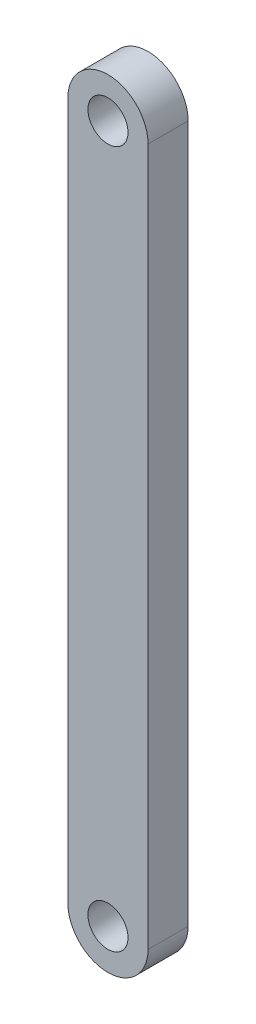
ISO-10303-21;
HEADER;
FILE_DESCRIPTION(('STEP AP214'),'2;1');
FILE_NAME('part.step','',(''),(''),'','','');
FILE_SCHEMA(('AUTOMOTIVE_DESIGN { 1 0 10303 214 1 1 1 1 }'));
ENDSEC;
DATA;
#1=APPLICATION_CONTEXT('core data for automotive mechanical design processes');
#2=APPLICATION_PROTOCOL_DEFINITION('international standard','automotive_design',2000,#1);
#3=PRODUCT_CONTEXT('',#1,'mechanical');
#4=PRODUCT('Part','Part','',(#3));
#5=PRODUCT_RELATED_PRODUCT_CATEGORY('part','',(#4));
#6=PRODUCT_DEFINITION_FORMATION('','',#4);
#7=PRODUCT_DEFINITION_CONTEXT('part definition',#1,'design');
#8=PRODUCT_DEFINITION('design','',#6,#7);
#9=PRODUCT_DEFINITION_SHAPE('','',#8);
#10=(LENGTH_UNIT() NAMED_UNIT(*) SI_UNIT(.MILLI.,.METRE.));
#11=(NAMED_UNIT(*) PLANE_ANGLE_UNIT() SI_UNIT($,.RADIAN.));
#12=(NAMED_UNIT(*) SI_UNIT($,.STERADIAN.) SOLID_ANGLE_UNIT());
#13=UNCERTAINTY_MEASURE_WITH_UNIT(LENGTH_MEASURE(1.E-05),#10,'distance_accuracy_value','');
#14=(GEOMETRIC_REPRESENTATION_CONTEXT(3) GLOBAL_UNCERTAINTY_ASSIGNED_CONTEXT((#13)) GLOBAL_UNIT_ASSIGNED_CONTEXT((#10,
#11,#12)) REPRESENTATION_CONTEXT('',''));
#15=CARTESIAN_POINT('',(0.,0.,0.));
#16=DIRECTION('',(0.,0.,1.));
#17=DIRECTION('',(1.,0.,0.));
#18=AXIS2_PLACEMENT_3D('',#15,#16,#17);
#19=CARTESIAN_POINT('',(-3.79008211886888E-13,110.49,6.35));
#20=DIRECTION('',(0.,0.,1.));
#21=DIRECTION('',(1.,0.,0.));
#22=AXIS2_PLACEMENT_3D('',#19,#20,#21);
#23=PLANE('',#22);
#24=CARTESIAN_POINT('',(-3.79008211886888E-13,110.49,6.35));
#25=DIRECTION('',(0.,0.,1.));
#26=DIRECTION('',(1.,0.,0.));
#27=AXIS2_PLACEMENT_3D('',#24,#25,#26);
#28=CIRCLE('',#27,3.175);
#29=CARTESIAN_POINT('',(3.17499999999962,110.49,6.35));
#30=VERTEX_POINT('',#29);
#31=EDGE_CURVE('E116',#30,#30,#28,.T.);
#32=ORIENTED_EDGE('',*,*,#31,.F.);
#33=EDGE_LOOP('',(#32));
#34=FACE_BOUND('',#33,.T.);
#35=CARTESIAN_POINT('',(-3.79008211886888E-13,110.49,6.35));
#36=DIRECTION('',(0.,0.,1.));
#37=DIRECTION('',(1.,0.,0.));
#38=AXIS2_PLACEMENT_3D('',#35,#36,#37);
#39=CIRCLE('',#38,6.35);
#40=CARTESIAN_POINT('',(6.35,110.49,6.35));
#41=VERTEX_POINT('',#40);
#42=CARTESIAN_POINT('',(-6.35,110.49,6.35));
#43=VERTEX_POINT('',#42);
#44=EDGE_CURVE('E96',#41,#43,#39,.T.);
#45=ORIENTED_EDGE('',*,*,#44,.T.);
#46=DIRECTION('',(0.,-1.,0.));
#47=VECTOR('',#46,1.);
#48=CARTESIAN_POINT('',(-6.35,110.49,6.35));
#49=LINE('',#48,#47);
#50=CARTESIAN_POINT('',(-6.35,0.,6.35));
#51=VERTEX_POINT('',#50);
#52=EDGE_CURVE('E91',#43,#51,#49,.T.);
#53=ORIENTED_EDGE('',*,*,#52,.T.);
#54=CARTESIAN_POINT('',(0.,0.,6.35));
#55=DIRECTION('',(0.,0.,1.));
#56=DIRECTION('',(1.,0.,0.));
#57=AXIS2_PLACEMENT_3D('',#54,#55,#56);
#58=CIRCLE('',#57,6.35);
#59=CARTESIAN_POINT('',(6.35,0.,6.35));
#60=VERTEX_POINT('',#59);
#61=EDGE_CURVE('E94',#51,#60,#58,.T.);
#62=ORIENTED_EDGE('',*,*,#61,.T.);
#63=DIRECTION('',(0.,1.,0.));
#64=VECTOR('',#63,1.);
#65=CARTESIAN_POINT('',(6.35,110.49,6.35));
#66=LINE('',#65,#64);
#67=EDGE_CURVE('E61',#60,#41,#66,.T.);
#68=ORIENTED_EDGE('',*,*,#67,.T.);
#69=EDGE_LOOP('',(#45,#53,#62,#68));
#70=FACE_BOUND('',#69,.T.);
#71=CARTESIAN_POINT('',(0.,0.,6.35));
#72=DIRECTION('',(0.,0.,1.));
#73=DIRECTION('',(1.,0.,0.));
#74=AXIS2_PLACEMENT_3D('',#71,#72,#73);
#75=CIRCLE('',#74,3.175);
#76=CARTESIAN_POINT('',(3.175,0.,6.35));
#77=VERTEX_POINT('',#76);
#78=EDGE_CURVE('E138',#77,#77,#75,.T.);
#79=ORIENTED_EDGE('',*,*,#78,.F.);
#80=EDGE_LOOP('',(#79));
#81=FACE_BOUND('',#80,.T.);
#82=ADVANCED_FACE('F43',(#34,#70,#81),#23,.T.);
#83=CARTESIAN_POINT('',(-3.79008211886888E-13,110.49,0.));
#84=DIRECTION('',(0.,0.,1.));
#85=DIRECTION('',(1.,0.,0.));
#86=AXIS2_PLACEMENT_3D('',#83,#84,#85);
#87=PLANE('',#86);
#88=CARTESIAN_POINT('',(-3.79008211886888E-13,110.49,0.));
#89=DIRECTION('',(0.,0.,1.));
#90=DIRECTION('',(1.,0.,0.));
#91=AXIS2_PLACEMENT_3D('',#88,#89,#90);
#92=CIRCLE('',#91,6.35);
#93=CARTESIAN_POINT('',(6.35,110.49,0.));
#94=VERTEX_POINT('',#93);
#95=CARTESIAN_POINT('',(-6.35,110.49,0.));
#96=VERTEX_POINT('',#95);
#97=EDGE_CURVE('E112',#94,#96,#92,.T.);
#98=ORIENTED_EDGE('',*,*,#97,.F.);
#99=DIRECTION('',(0.,1.,0.));
#100=VECTOR('',#99,1.);
#101=CARTESIAN_POINT('',(6.35,110.49,0.));
#102=LINE('',#101,#100);
#103=CARTESIAN_POINT('',(6.35,0.,0.));
#104=VERTEX_POINT('',#103);
#105=EDGE_CURVE('E84',#104,#94,#102,.T.);
#106=ORIENTED_EDGE('',*,*,#105,.F.);
#107=CARTESIAN_POINT('',(0.,0.,0.));
#108=DIRECTION('',(0.,0.,1.));
#109=DIRECTION('',(1.,0.,0.));
#110=AXIS2_PLACEMENT_3D('',#107,#108,#109);
#111=CIRCLE('',#110,6.35);
#112=CARTESIAN_POINT('',(-6.35,0.,0.));
#113=VERTEX_POINT('',#112);
#114=EDGE_CURVE('E78',#113,#104,#111,.T.);
#115=ORIENTED_EDGE('',*,*,#114,.F.);
#116=DIRECTION('',(0.,-1.,0.));
#117=VECTOR('',#116,1.);
#118=CARTESIAN_POINT('',(-6.35,110.49,0.));
#119=LINE('',#118,#117);
#120=EDGE_CURVE('E101',#96,#113,#119,.T.);
#121=ORIENTED_EDGE('',*,*,#120,.F.);
#122=EDGE_LOOP('',(#98,#106,#115,#121));
#123=FACE_BOUND('',#122,.T.);
#124=CARTESIAN_POINT('',(-3.79008211886888E-13,110.49,0.));
#125=DIRECTION('',(0.,0.,1.));
#126=DIRECTION('',(1.,0.,0.));
#127=AXIS2_PLACEMENT_3D('',#124,#125,#126);
#128=CIRCLE('',#127,3.175);
#129=CARTESIAN_POINT('',(3.17499999999962,110.49,0.));
#130=VERTEX_POINT('',#129);
#131=EDGE_CURVE('E134',#130,#130,#128,.T.);
#132=ORIENTED_EDGE('',*,*,#131,.T.);
#133=EDGE_LOOP('',(#132));
#134=FACE_BOUND('',#133,.T.);
#135=CARTESIAN_POINT('',(0.,0.,0.));
#136=DIRECTION('',(0.,0.,1.));
#137=DIRECTION('',(1.,0.,0.));
#138=AXIS2_PLACEMENT_3D('',#135,#136,#137);
#139=CIRCLE('',#138,3.175);
#140=CARTESIAN_POINT('',(3.175,0.,0.));
#141=VERTEX_POINT('',#140);
#142=EDGE_CURVE('E142',#141,#141,#139,.T.);
#143=ORIENTED_EDGE('',*,*,#142,.T.);
#144=EDGE_LOOP('',(#143));
#145=FACE_BOUND('',#144,.T.);
#146=ADVANCED_FACE('F129',(#123,#134,#145),#87,.F.);
#147=CARTESIAN_POINT('',(-3.79008211886888E-13,110.49,6.35));
#148=DIRECTION('',(0.,0.,-1.));
#149=DIRECTION('',(-1.,0.,0.));
#150=AXIS2_PLACEMENT_3D('',#147,#148,#149);
#151=CYLINDRICAL_SURFACE('',#150,6.35);
#152=ORIENTED_EDGE('',*,*,#97,.T.);
#153=DIRECTION('',(0.,0.,-1.));
#154=VECTOR('',#153,1.);
#155=CARTESIAN_POINT('',(-6.35,110.49,6.35));
#156=LINE('',#155,#154);
#157=EDGE_CURVE('E11',#43,#96,#156,.T.);
#158=ORIENTED_EDGE('',*,*,#157,.F.);
#159=ORIENTED_EDGE('',*,*,#44,.F.);
#160=DIRECTION('',(0.,0.,-1.));
#161=VECTOR('',#160,1.);
#162=CARTESIAN_POINT('',(6.35,110.49,6.35));
#163=LINE('',#162,#161);
#164=EDGE_CURVE('E108',#41,#94,#163,.T.);
#165=ORIENTED_EDGE('',*,*,#164,.T.);
#166=EDGE_LOOP('',(#152,#158,#159,#165));
#167=FACE_BOUND('',#166,.T.);
#168=ADVANCED_FACE('F45',(#167),#151,.T.);
#169=CARTESIAN_POINT('',(-6.35,110.49,6.35));
#170=DIRECTION('',(1.,0.,0.));
#171=DIRECTION('',(0.,0.,-1.));
#172=AXIS2_PLACEMENT_3D('',#169,#170,#171);
#173=PLANE('',#172);
#174=ORIENTED_EDGE('',*,*,#120,.T.);
#175=DIRECTION('',(0.,0.,-1.));
#176=VECTOR('',#175,1.);
#177=CARTESIAN_POINT('',(-6.35,0.,6.35));
#178=LINE('',#177,#176);
#179=EDGE_CURVE('E53',#51,#113,#178,.T.);
#180=ORIENTED_EDGE('',*,*,#179,.F.);
#181=ORIENTED_EDGE('',*,*,#52,.F.);
#182=ORIENTED_EDGE('',*,*,#157,.T.);
#183=EDGE_LOOP('',(#174,#180,#181,#182));
#184=FACE_BOUND('',#183,.T.);
#185=ADVANCED_FACE('F100',(#184),#173,.F.);
#186=CARTESIAN_POINT('',(0.,0.,6.35));
#187=DIRECTION('',(0.,0.,-1.));
#188=DIRECTION('',(-1.,0.,0.));
#189=AXIS2_PLACEMENT_3D('',#186,#187,#188);
#190=CYLINDRICAL_SURFACE('',#189,6.35);
#191=ORIENTED_EDGE('',*,*,#114,.T.);
#192=DIRECTION('',(0.,0.,-1.));
#193=VECTOR('',#192,1.);
#194=CARTESIAN_POINT('',(6.35,0.,6.35));
#195=LINE('',#194,#193);
#196=EDGE_CURVE('E103',#60,#104,#195,.T.);
#197=ORIENTED_EDGE('',*,*,#196,.F.);
#198=ORIENTED_EDGE('',*,*,#61,.F.);
#199=ORIENTED_EDGE('',*,*,#179,.T.);
#200=EDGE_LOOP('',(#191,#197,#198,#199));
#201=FACE_BOUND('',#200,.T.);
#202=ADVANCED_FACE('F104',(#201),#190,.T.);
#203=CARTESIAN_POINT('',(6.35,110.49,6.35));
#204=DIRECTION('',(-1.,0.,0.));
#205=DIRECTION('',(0.,0.,1.));
#206=AXIS2_PLACEMENT_3D('',#203,#204,#205);
#207=PLANE('',#206);
#208=ORIENTED_EDGE('',*,*,#105,.T.);
#209=ORIENTED_EDGE('',*,*,#164,.F.);
#210=ORIENTED_EDGE('',*,*,#67,.F.);
#211=ORIENTED_EDGE('',*,*,#196,.T.);
#212=EDGE_LOOP('',(#208,#209,#210,#211));
#213=FACE_BOUND('',#212,.T.);
#214=ADVANCED_FACE('F126',(#213),#207,.F.);
#215=CARTESIAN_POINT('',(-3.79008211886888E-13,110.49,6.35));
#216=DIRECTION('',(0.,0.,-1.));
#217=DIRECTION('',(-1.,0.,0.));
#218=AXIS2_PLACEMENT_3D('',#215,#216,#217);
#219=CYLINDRICAL_SURFACE('',#218,3.175);
#220=ORIENTED_EDGE('',*,*,#31,.T.);
#221=EDGE_LOOP('',(#220));
#222=FACE_BOUND('',#221,.T.);
#223=ORIENTED_EDGE('',*,*,#131,.F.);
#224=EDGE_LOOP('',(#223));
#225=FACE_BOUND('',#224,.T.);
#226=ADVANCED_FACE('F161',(#222,#225),#219,.F.);
#227=CARTESIAN_POINT('',(0.,0.,6.35));
#228=DIRECTION('',(0.,0.,-1.));
#229=DIRECTION('',(-1.,0.,0.));
#230=AXIS2_PLACEMENT_3D('',#227,#228,#229);
#231=CYLINDRICAL_SURFACE('',#230,3.175);
#232=ORIENTED_EDGE('',*,*,#78,.T.);
#233=EDGE_LOOP('',(#232));
#234=FACE_BOUND('',#233,.T.);
#235=ORIENTED_EDGE('',*,*,#142,.F.);
#236=EDGE_LOOP('',(#235));
#237=FACE_BOUND('',#236,.T.);
#238=ADVANCED_FACE('F150',(#234,#237),#231,.F.);
#239=CLOSED_SHELL('',(#82,#146,#168,#185,#202,#214,#226,#238));
#240=MANIFOLD_SOLID_BREP('B2',#239);
#241=ADVANCED_BREP_SHAPE_REPRESENTATION('',(#18,#240),#14);
#242=SHAPE_DEFINITION_REPRESENTATION(#9,#241);
ENDSEC;
END-ISO-10303-21;
